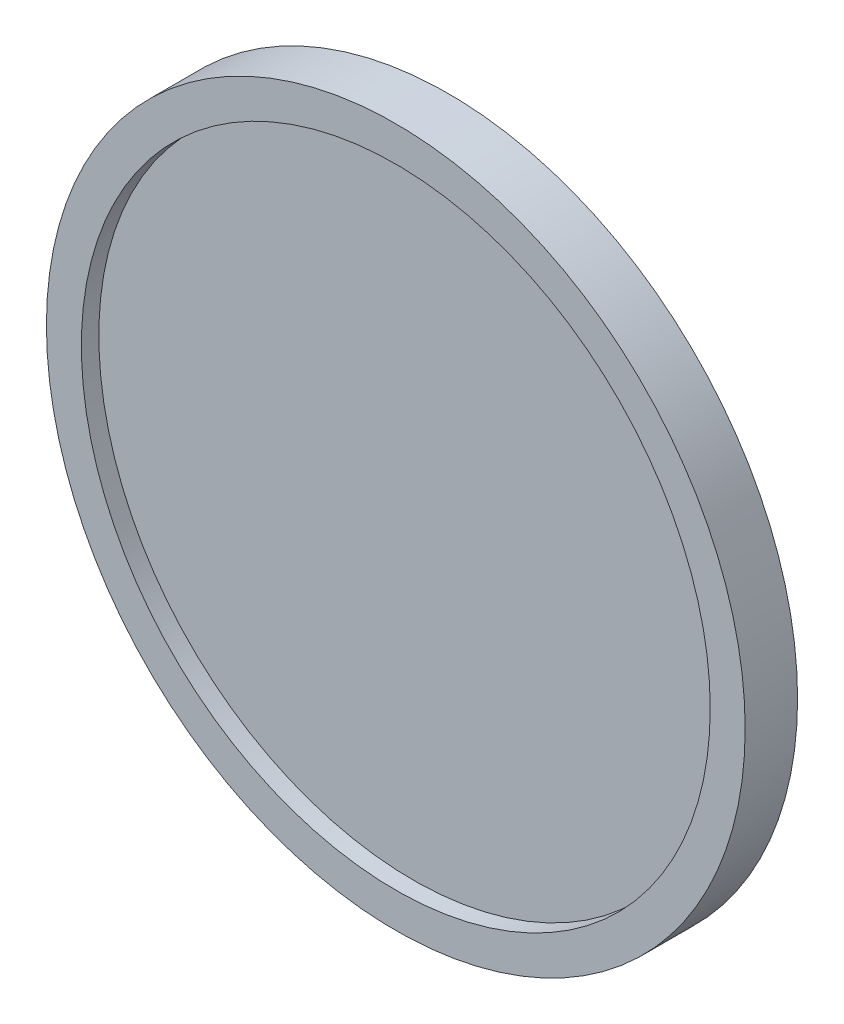
ISO-10303-21;
HEADER;
FILE_DESCRIPTION(('STEP AP214'),'2;1');
FILE_NAME('part.step','',(''),(''),'','','');
FILE_SCHEMA(('AUTOMOTIVE_DESIGN { 1 0 10303 214 1 1 1 1 }'));
ENDSEC;
DATA;
#1=APPLICATION_CONTEXT('core data for automotive mechanical design processes');
#2=APPLICATION_PROTOCOL_DEFINITION('international standard','automotive_design',2000,#1);
#3=PRODUCT_CONTEXT('',#1,'mechanical');
#4=PRODUCT('Part','Part','',(#3));
#5=PRODUCT_RELATED_PRODUCT_CATEGORY('part','',(#4));
#6=PRODUCT_DEFINITION_FORMATION('','',#4);
#7=PRODUCT_DEFINITION_CONTEXT('part definition',#1,'design');
#8=PRODUCT_DEFINITION('design','',#6,#7);
#9=PRODUCT_DEFINITION_SHAPE('','',#8);
#10=(LENGTH_UNIT() NAMED_UNIT(*) SI_UNIT(.MILLI.,.METRE.));
#11=(NAMED_UNIT(*) PLANE_ANGLE_UNIT() SI_UNIT($,.RADIAN.));
#12=(NAMED_UNIT(*) SI_UNIT($,.STERADIAN.) SOLID_ANGLE_UNIT());
#13=UNCERTAINTY_MEASURE_WITH_UNIT(LENGTH_MEASURE(1.E-05),#10,'distance_accuracy_value','');
#14=(GEOMETRIC_REPRESENTATION_CONTEXT(3) GLOBAL_UNCERTAINTY_ASSIGNED_CONTEXT((#13)) GLOBAL_UNIT_ASSIGNED_CONTEXT((#10,
#11,#12)) REPRESENTATION_CONTEXT('',''));
#15=CARTESIAN_POINT('',(0.,0.,0.));
#16=DIRECTION('',(0.,0.,1.));
#17=DIRECTION('',(1.,0.,0.));
#18=AXIS2_PLACEMENT_3D('',#15,#16,#17);
#19=CARTESIAN_POINT('',(0.,0.,2.));
#20=DIRECTION('',(0.,0.,-1.));
#21=DIRECTION('',(-1.,0.,0.));
#22=AXIS2_PLACEMENT_3D('',#19,#20,#21);
#23=CYLINDRICAL_SURFACE('',#22,20.);
#24=CARTESIAN_POINT('',(0.,0.,0.));
#25=DIRECTION('',(0.,0.,1.));
#26=DIRECTION('',(1.,0.,0.));
#27=AXIS2_PLACEMENT_3D('',#24,#25,#26);
#28=CIRCLE('',#27,20.);
#29=CARTESIAN_POINT('',(20.,0.,0.));
#30=VERTEX_POINT('',#29);
#31=EDGE_CURVE('E39',#30,#30,#28,.T.);
#32=ORIENTED_EDGE('',*,*,#31,.T.);
#33=EDGE_LOOP('',(#32));
#34=FACE_BOUND('',#33,.T.);
#35=CARTESIAN_POINT('',(0.,0.,3.));
#36=DIRECTION('',(0.,0.,1.));
#37=DIRECTION('',(1.,0.,0.));
#38=AXIS2_PLACEMENT_3D('',#35,#36,#37);
#39=CIRCLE('',#38,20.);
#40=CARTESIAN_POINT('',(20.,0.,3.));
#41=VERTEX_POINT('',#40);
#42=EDGE_CURVE('E43',#41,#41,#39,.T.);
#43=ORIENTED_EDGE('',*,*,#42,.F.);
#44=EDGE_LOOP('',(#43));
#45=FACE_BOUND('',#44,.T.);
#46=ADVANCED_FACE('F33',(#34,#45),#23,.T.);
#47=CARTESIAN_POINT('',(0.,0.,0.));
#48=DIRECTION('',(0.,0.,1.));
#49=DIRECTION('',(1.,0.,0.));
#50=AXIS2_PLACEMENT_3D('',#47,#48,#49);
#51=PLANE('',#50);
#52=ORIENTED_EDGE('',*,*,#31,.F.);
#53=EDGE_LOOP('',(#52));
#54=FACE_BOUND('',#53,.T.);
#55=ADVANCED_FACE('F57',(#54),#51,.F.);
#56=CARTESIAN_POINT('',(0.,0.,3.));
#57=DIRECTION('',(0.,0.,1.));
#58=DIRECTION('',(1.,0.,0.));
#59=AXIS2_PLACEMENT_3D('',#56,#57,#58);
#60=PLANE('',#59);
#61=ORIENTED_EDGE('',*,*,#42,.T.);
#62=EDGE_LOOP('',(#61));
#63=FACE_BOUND('',#62,.T.);
#64=CARTESIAN_POINT('',(0.,0.,3.));
#65=DIRECTION('',(0.,0.,1.));
#66=DIRECTION('',(1.,0.,0.));
#67=AXIS2_PLACEMENT_3D('',#64,#65,#66);
#68=CIRCLE('',#67,18.);
#69=CARTESIAN_POINT('',(18.,0.,3.));
#70=VERTEX_POINT('',#69);
#71=EDGE_CURVE('E47',#70,#70,#68,.T.);
#72=ORIENTED_EDGE('',*,*,#71,.F.);
#73=EDGE_LOOP('',(#72));
#74=FACE_BOUND('',#73,.T.);
#75=ADVANCED_FACE('F55',(#63,#74),#60,.T.);
#76=CARTESIAN_POINT('',(0.,0.,3.));
#77=DIRECTION('',(0.,0.,-1.));
#78=DIRECTION('',(-1.,0.,0.));
#79=AXIS2_PLACEMENT_3D('',#76,#77,#78);
#80=CYLINDRICAL_SURFACE('',#79,18.);
#81=ORIENTED_EDGE('',*,*,#71,.T.);
#82=EDGE_LOOP('',(#81));
#83=FACE_BOUND('',#82,.T.);
#84=CARTESIAN_POINT('',(0.,0.,2.));
#85=DIRECTION('',(0.,0.,1.));
#86=DIRECTION('',(1.,0.,0.));
#87=AXIS2_PLACEMENT_3D('',#84,#85,#86);
#88=CIRCLE('',#87,18.);
#89=CARTESIAN_POINT('',(18.,0.,2.));
#90=VERTEX_POINT('',#89);
#91=EDGE_CURVE('E10',#90,#90,#88,.F.);
#92=ORIENTED_EDGE('',*,*,#91,.T.);
#93=EDGE_LOOP('',(#92));
#94=FACE_BOUND('',#93,.T.);
#95=ADVANCED_FACE('F53',(#83,#94),#80,.F.);
#96=CARTESIAN_POINT('',(0.,0.,2.));
#97=DIRECTION('',(0.,0.,1.));
#98=DIRECTION('',(1.,0.,0.));
#99=AXIS2_PLACEMENT_3D('',#96,#97,#98);
#100=PLANE('',#99);
#101=ORIENTED_EDGE('',*,*,#91,.F.);
#102=EDGE_LOOP('',(#101));
#103=FACE_BOUND('',#102,.T.);
#104=ADVANCED_FACE('F64',(#103),#100,.T.);
#105=CLOSED_SHELL('',(#46,#55,#75,#95,#104));
#106=MANIFOLD_SOLID_BREP('B2',#105);
#107=ADVANCED_BREP_SHAPE_REPRESENTATION('',(#18,#106),#14);
#108=SHAPE_DEFINITION_REPRESENTATION(#9,#107);
ENDSEC;
END-ISO-10303-21;
